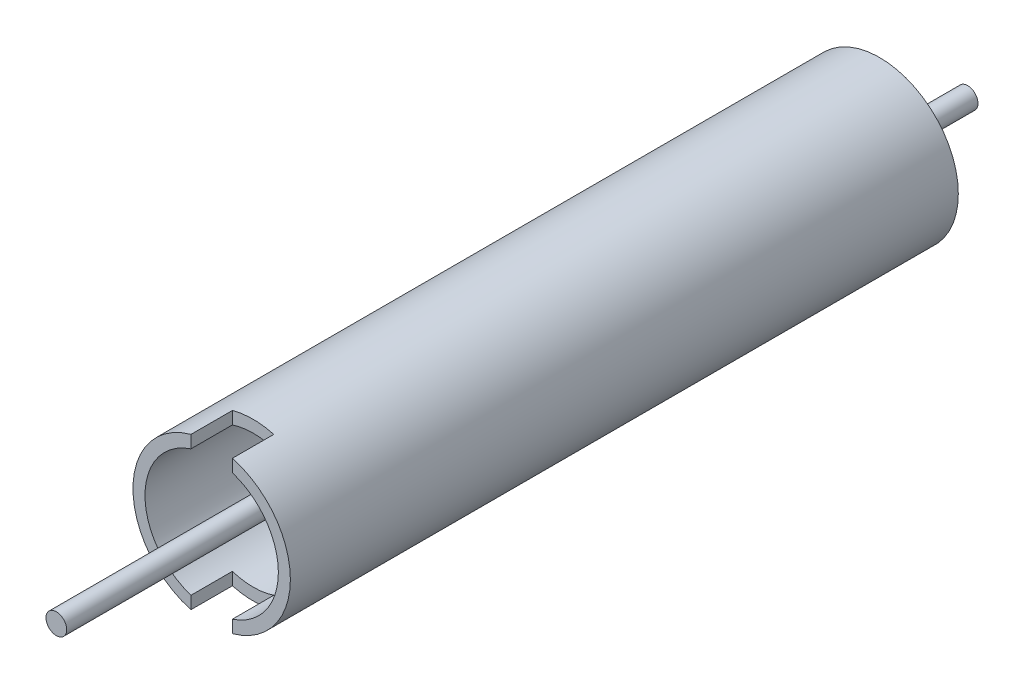
ISO-10303-21;
HEADER;
FILE_DESCRIPTION(('STEP AP214'),'2;1');
FILE_NAME('part.step','',(''),(''),'','','');
FILE_SCHEMA(('AUTOMOTIVE_DESIGN { 1 0 10303 214 1 1 1 1 }'));
ENDSEC;
DATA;
#1=APPLICATION_CONTEXT('core data for automotive mechanical design processes');
#2=APPLICATION_PROTOCOL_DEFINITION('international standard','automotive_design',2000,#1);
#3=PRODUCT_CONTEXT('',#1,'mechanical');
#4=PRODUCT('Part','Part','',(#3));
#5=PRODUCT_RELATED_PRODUCT_CATEGORY('part','',(#4));
#6=PRODUCT_DEFINITION_FORMATION('','',#4);
#7=PRODUCT_DEFINITION_CONTEXT('part definition',#1,'design');
#8=PRODUCT_DEFINITION('design','',#6,#7);
#9=PRODUCT_DEFINITION_SHAPE('','',#8);
#10=(LENGTH_UNIT() NAMED_UNIT(*) SI_UNIT(.MILLI.,.METRE.));
#11=(NAMED_UNIT(*) PLANE_ANGLE_UNIT() SI_UNIT($,.RADIAN.));
#12=(NAMED_UNIT(*) SI_UNIT($,.STERADIAN.) SOLID_ANGLE_UNIT());
#13=UNCERTAINTY_MEASURE_WITH_UNIT(LENGTH_MEASURE(1.E-05),#10,'distance_accuracy_value','');
#14=(GEOMETRIC_REPRESENTATION_CONTEXT(3) GLOBAL_UNCERTAINTY_ASSIGNED_CONTEXT((#13)) GLOBAL_UNIT_ASSIGNED_CONTEXT((#10,
#11,#12)) REPRESENTATION_CONTEXT('',''));
#15=CARTESIAN_POINT('',(0.,0.,0.));
#16=DIRECTION('',(0.,0.,1.));
#17=DIRECTION('',(1.,0.,0.));
#18=AXIS2_PLACEMENT_3D('',#15,#16,#17);
#19=CARTESIAN_POINT('',(0.,0.,92.075));
#20=DIRECTION('',(0.,0.,1.));
#21=DIRECTION('',(1.,0.,0.));
#22=AXIS2_PLACEMENT_3D('',#19,#20,#21);
#23=PLANE('',#22);
#24=CARTESIAN_POINT('',(0.,0.,92.075));
#25=DIRECTION('',(0.,0.,1.));
#26=DIRECTION('',(1.,0.,0.));
#27=AXIS2_PLACEMENT_3D('',#24,#25,#26);
#28=CIRCLE('',#27,24.13);
#29=CARTESIAN_POINT('',(-6.35000000000003,23.2794845303757,92.075));
#30=VERTEX_POINT('',#29);
#31=CARTESIAN_POINT('',(-6.35000000000003,-23.2794845303757,92.075));
#32=VERTEX_POINT('',#31);
#33=EDGE_CURVE('E197',#30,#32,#28,.T.);
#34=ORIENTED_EDGE('',*,*,#33,.T.);
#35=DIRECTION('',(0.,-1.,0.));
#36=VECTOR('',#35,1.);
#37=CARTESIAN_POINT('',(-6.35000000000003,-19.4359797540541,92.075));
#38=LINE('',#37,#36);
#39=CARTESIAN_POINT('',(-6.35000000000003,-19.4359797540541,92.075));
#40=VERTEX_POINT('',#39);
#41=EDGE_CURVE('E146',#40,#32,#38,.T.);
#42=ORIENTED_EDGE('',*,*,#41,.F.);
#43=CARTESIAN_POINT('',(0.,0.,92.075));
#44=DIRECTION('',(0.,0.,1.));
#45=DIRECTION('',(1.,0.,0.));
#46=AXIS2_PLACEMENT_3D('',#43,#44,#45);
#47=CIRCLE('',#46,20.447);
#48=CARTESIAN_POINT('',(-6.35000000000003,19.4359797540541,92.075));
#49=VERTEX_POINT('',#48);
#50=EDGE_CURVE('E193',#49,#40,#47,.T.);
#51=ORIENTED_EDGE('',*,*,#50,.F.);
#52=DIRECTION('',(0.,1.,0.));
#53=VECTOR('',#52,1.);
#54=CARTESIAN_POINT('',(-6.35000000000003,19.4359797540541,92.075));
#55=LINE('',#54,#53);
#56=EDGE_CURVE('E161',#49,#30,#55,.T.);
#57=ORIENTED_EDGE('',*,*,#56,.T.);
#58=EDGE_LOOP('',(#34,#42,#51,#57));
#59=FACE_BOUND('',#58,.T.);
#60=ADVANCED_FACE('F46',(#59),#23,.T.);
#61=CARTESIAN_POINT('',(0.,0.,-112.7125));
#62=DIRECTION('',(0.,0.,1.));
#63=DIRECTION('',(1.,0.,0.));
#64=AXIS2_PLACEMENT_3D('',#61,#62,#63);
#65=CYLINDRICAL_SURFACE('',#64,24.13);
#66=DIRECTION('',(0.,0.,1.));
#67=VECTOR('',#66,1.);
#68=CARTESIAN_POINT('',(6.34999999999999,-23.2794845303757,-112.7125));
#69=LINE('',#68,#67);
#70=CARTESIAN_POINT('',(6.34999999999999,-23.2794845303757,92.075));
#71=VERTEX_POINT('',#70);
#72=CARTESIAN_POINT('',(6.34999999999999,-23.2794845303757,79.3749999999999));
#73=VERTEX_POINT('',#72);
#74=EDGE_CURVE('E130',#71,#73,#69,.F.);
#75=ORIENTED_EDGE('',*,*,#74,.T.);
#76=CARTESIAN_POINT('',(0.,0.,79.3749999999999));
#77=DIRECTION('',(0.,0.,1.));
#78=DIRECTION('',(1.,0.,0.));
#79=AXIS2_PLACEMENT_3D('',#76,#77,#78);
#80=CIRCLE('',#79,24.13);
#81=CARTESIAN_POINT('',(-6.35000000000003,-23.2794845303757,79.3749999999999));
#82=VERTEX_POINT('',#81);
#83=EDGE_CURVE('E114',#82,#73,#80,.T.);
#84=ORIENTED_EDGE('',*,*,#83,.F.);
#85=DIRECTION('',(0.,0.,1.));
#86=VECTOR('',#85,1.);
#87=CARTESIAN_POINT('',(-6.35000000000003,-23.2794845303757,-112.7125));
#88=LINE('',#87,#86);
#89=EDGE_CURVE('E126',#32,#82,#88,.F.);
#90=ORIENTED_EDGE('',*,*,#89,.F.);
#91=ORIENTED_EDGE('',*,*,#33,.F.);
#92=DIRECTION('',(0.,0.,1.));
#93=VECTOR('',#92,1.);
#94=CARTESIAN_POINT('',(-6.35000000000003,23.2794845303757,-112.7125));
#95=LINE('',#94,#93);
#96=CARTESIAN_POINT('',(-6.35000000000003,23.2794845303757,79.3749999999999));
#97=VERTEX_POINT('',#96);
#98=EDGE_CURVE('E168',#30,#97,#95,.F.);
#99=ORIENTED_EDGE('',*,*,#98,.T.);
#100=CARTESIAN_POINT('',(0.,0.,79.3749999999999));
#101=DIRECTION('',(0.,0.,-1.));
#102=DIRECTION('',(-1.,0.,0.));
#103=AXIS2_PLACEMENT_3D('',#100,#101,#102);
#104=CIRCLE('',#103,24.13);
#105=CARTESIAN_POINT('',(6.34999999999999,23.2794845303757,79.3749999999999));
#106=VERTEX_POINT('',#105);
#107=EDGE_CURVE('E162',#97,#106,#104,.T.);
#108=ORIENTED_EDGE('',*,*,#107,.T.);
#109=DIRECTION('',(0.,0.,1.));
#110=VECTOR('',#109,1.);
#111=CARTESIAN_POINT('',(6.34999999999999,23.2794845303757,-112.7125));
#112=LINE('',#111,#110);
#113=CARTESIAN_POINT('',(6.34999999999999,23.2794845303757,92.075));
#114=VERTEX_POINT('',#113);
#115=EDGE_CURVE('E172',#114,#106,#112,.F.);
#116=ORIENTED_EDGE('',*,*,#115,.F.);
#117=EDGE_CURVE('E140',#71,#114,#28,.T.);
#118=ORIENTED_EDGE('',*,*,#117,.F.);
#119=EDGE_LOOP('',(#75,#84,#90,#91,#99,#108,#116,#118));
#120=FACE_BOUND('',#119,.T.);
#121=CARTESIAN_POINT('',(0.,0.,-112.7125));
#122=DIRECTION('',(0.,0.,1.));
#123=DIRECTION('',(1.,0.,0.));
#124=AXIS2_PLACEMENT_3D('',#121,#122,#123);
#125=CIRCLE('',#124,24.13);
#126=CARTESIAN_POINT('',(24.13,0.,-112.7125));
#127=VERTEX_POINT('',#126);
#128=EDGE_CURVE('E12',#127,#127,#125,.T.);
#129=ORIENTED_EDGE('',*,*,#128,.T.);
#130=EDGE_LOOP('',(#129));
#131=FACE_BOUND('',#130,.T.);
#132=ADVANCED_FACE('F48',(#120,#131),#65,.T.);
#133=CARTESIAN_POINT('',(0.,0.,-112.7125));
#134=DIRECTION('',(0.,0.,1.));
#135=DIRECTION('',(1.,0.,0.));
#136=AXIS2_PLACEMENT_3D('',#133,#134,#135);
#137=PLANE('',#136);
#138=CARTESIAN_POINT('',(0.,0.,-112.7125));
#139=DIRECTION('',(0.,0.,1.));
#140=DIRECTION('',(1.,0.,0.));
#141=AXIS2_PLACEMENT_3D('',#138,#139,#140);
#142=CIRCLE('',#141,20.447);
#143=CARTESIAN_POINT('',(20.447,0.,-112.7125));
#144=VERTEX_POINT('',#143);
#145=EDGE_CURVE('E55',#144,#144,#142,.T.);
#146=ORIENTED_EDGE('',*,*,#145,.T.);
#147=EDGE_LOOP('',(#146));
#148=FACE_BOUND('',#147,.T.);
#149=ORIENTED_EDGE('',*,*,#128,.F.);
#150=EDGE_LOOP('',(#149));
#151=FACE_BOUND('',#150,.T.);
#152=ADVANCED_FACE('F204',(#148,#151),#137,.F.);
#153=CARTESIAN_POINT('',(0.,0.,-112.7125));
#154=DIRECTION('',(0.,0.,1.));
#155=DIRECTION('',(1.,0.,0.));
#156=AXIS2_PLACEMENT_3D('',#153,#154,#155);
#157=CYLINDRICAL_SURFACE('',#156,20.447);
#158=CARTESIAN_POINT('',(0.,0.,79.375));
#159=DIRECTION('',(0.,0.,-1.));
#160=DIRECTION('',(-1.,0.,0.));
#161=AXIS2_PLACEMENT_3D('',#158,#159,#160);
#162=CIRCLE('',#161,20.447);
#163=CARTESIAN_POINT('',(6.34999999999999,-19.4359797540541,79.3749999999999));
#164=VERTEX_POINT('',#163);
#165=CARTESIAN_POINT('',(-6.35000000000003,-19.4359797540541,79.3749999999999));
#166=VERTEX_POINT('',#165);
#167=EDGE_CURVE('E125',#164,#166,#162,.T.);
#168=ORIENTED_EDGE('',*,*,#167,.F.);
#169=DIRECTION('',(0.,0.,1.));
#170=VECTOR('',#169,1.);
#171=CARTESIAN_POINT('',(6.34999999999999,-19.4359797540541,-112.7125));
#172=LINE('',#171,#170);
#173=CARTESIAN_POINT('',(6.34999999999999,-19.4359797540541,92.0749999999999));
#174=VERTEX_POINT('',#173);
#175=EDGE_CURVE('E132',#164,#174,#172,.T.);
#176=ORIENTED_EDGE('',*,*,#175,.T.);
#177=CARTESIAN_POINT('',(6.34999999999999,19.4359797540541,92.075));
#178=VERTEX_POINT('',#177);
#179=EDGE_CURVE('E70',#174,#178,#47,.T.);
#180=ORIENTED_EDGE('',*,*,#179,.T.);
#181=DIRECTION('',(0.,0.,1.));
#182=VECTOR('',#181,1.);
#183=CARTESIAN_POINT('',(6.34999999999999,19.4359797540541,-112.7125));
#184=LINE('',#183,#182);
#185=CARTESIAN_POINT('',(6.34999999999999,19.4359797540541,79.3749999999999));
#186=VERTEX_POINT('',#185);
#187=EDGE_CURVE('E169',#186,#178,#184,.T.);
#188=ORIENTED_EDGE('',*,*,#187,.F.);
#189=CARTESIAN_POINT('',(0.,0.,79.375));
#190=DIRECTION('',(0.,0.,1.));
#191=DIRECTION('',(1.,0.,0.));
#192=AXIS2_PLACEMENT_3D('',#189,#190,#191);
#193=CIRCLE('',#192,20.447);
#194=CARTESIAN_POINT('',(-6.35000000000003,19.4359797540541,79.3749999999999));
#195=VERTEX_POINT('',#194);
#196=EDGE_CURVE('E157',#186,#195,#193,.T.);
#197=ORIENTED_EDGE('',*,*,#196,.T.);
#198=DIRECTION('',(0.,0.,1.));
#199=VECTOR('',#198,1.);
#200=CARTESIAN_POINT('',(-6.35000000000003,19.4359797540541,-112.7125));
#201=LINE('',#200,#199);
#202=EDGE_CURVE('E163',#195,#49,#201,.T.);
#203=ORIENTED_EDGE('',*,*,#202,.T.);
#204=ORIENTED_EDGE('',*,*,#50,.T.);
#205=DIRECTION('',(0.,0.,1.));
#206=VECTOR('',#205,1.);
#207=CARTESIAN_POINT('',(-6.35000000000003,-19.4359797540541,-112.7125));
#208=LINE('',#207,#206);
#209=EDGE_CURVE('E62',#166,#40,#208,.T.);
#210=ORIENTED_EDGE('',*,*,#209,.F.);
#211=EDGE_LOOP('',(#168,#176,#180,#188,#197,#203,#204,#210));
#212=FACE_BOUND('',#211,.T.);
#213=ORIENTED_EDGE('',*,*,#145,.F.);
#214=EDGE_LOOP('',(#213));
#215=FACE_BOUND('',#214,.T.);
#216=ADVANCED_FACE('F207',(#212,#215),#157,.F.);
#217=DIRECTION('',(0.,-1.,0.));
#218=VECTOR('',#217,1.);
#219=CARTESIAN_POINT('',(6.34999999999999,-19.4359797540541,92.075));
#220=LINE('',#219,#218);
#221=EDGE_CURVE('E142',#174,#71,#220,.T.);
#222=ORIENTED_EDGE('',*,*,#221,.T.);
#223=ORIENTED_EDGE('',*,*,#117,.T.);
#224=DIRECTION('',(0.,1.,0.));
#225=VECTOR('',#224,1.);
#226=CARTESIAN_POINT('',(6.34999999999999,19.4359797540541,92.075));
#227=LINE('',#226,#225);
#228=EDGE_CURVE('E167',#178,#114,#227,.T.);
#229=ORIENTED_EDGE('',*,*,#228,.F.);
#230=ORIENTED_EDGE('',*,*,#179,.F.);
#231=EDGE_LOOP('',(#222,#223,#229,#230));
#232=FACE_BOUND('',#231,.T.);
#233=ADVANCED_FACE('F209',(#232),#23,.T.);
#234=CARTESIAN_POINT('',(-6.35000000000003,19.4359797540541,79.3749999999999));
#235=DIRECTION('',(0.,0.,-1.));
#236=DIRECTION('',(-1.,0.,0.));
#237=AXIS2_PLACEMENT_3D('',#234,#235,#236);
#238=PLANE('',#237);
#239=DIRECTION('',(0.,1.,0.));
#240=VECTOR('',#239,1.);
#241=CARTESIAN_POINT('',(-6.35000000000003,19.4359797540541,79.3749999999999));
#242=LINE('',#241,#240);
#243=EDGE_CURVE('E135',#195,#97,#242,.T.);
#244=ORIENTED_EDGE('',*,*,#243,.F.);
#245=ORIENTED_EDGE('',*,*,#196,.F.);
#246=DIRECTION('',(0.,1.,0.));
#247=VECTOR('',#246,1.);
#248=CARTESIAN_POINT('',(6.34999999999999,19.4359797540541,79.3749999999999));
#249=LINE('',#248,#247);
#250=EDGE_CURVE('E173',#186,#106,#249,.T.);
#251=ORIENTED_EDGE('',*,*,#250,.T.);
#252=ORIENTED_EDGE('',*,*,#107,.F.);
#253=EDGE_LOOP('',(#244,#245,#251,#252));
#254=FACE_BOUND('',#253,.T.);
#255=ADVANCED_FACE('F215',(#254),#238,.F.);
#256=CARTESIAN_POINT('',(-6.35000000000003,19.4359797540541,-112.7125));
#257=DIRECTION('',(-1.,0.,0.));
#258=DIRECTION('',(0.,0.,1.));
#259=AXIS2_PLACEMENT_3D('',#256,#257,#258);
#260=PLANE('',#259);
#261=ORIENTED_EDGE('',*,*,#56,.F.);
#262=ORIENTED_EDGE('',*,*,#202,.F.);
#263=ORIENTED_EDGE('',*,*,#243,.T.);
#264=ORIENTED_EDGE('',*,*,#98,.F.);
#265=EDGE_LOOP('',(#261,#262,#263,#264));
#266=FACE_BOUND('',#265,.T.);
#267=ADVANCED_FACE('F227',(#266),#260,.F.);
#268=CARTESIAN_POINT('',(6.34999999999999,19.4359797540541,-112.7125));
#269=DIRECTION('',(-1.,0.,0.));
#270=DIRECTION('',(0.,0.,1.));
#271=AXIS2_PLACEMENT_3D('',#268,#269,#270);
#272=PLANE('',#271);
#273=ORIENTED_EDGE('',*,*,#115,.T.);
#274=ORIENTED_EDGE('',*,*,#250,.F.);
#275=ORIENTED_EDGE('',*,*,#187,.T.);
#276=ORIENTED_EDGE('',*,*,#228,.T.);
#277=EDGE_LOOP('',(#273,#274,#275,#276));
#278=FACE_BOUND('',#277,.T.);
#279=ADVANCED_FACE('F231',(#278),#272,.T.);
#280=CARTESIAN_POINT('',(6.34999999999999,-19.4359797540541,-112.7125));
#281=DIRECTION('',(1.,0.,0.));
#282=DIRECTION('',(0.,0.,-1.));
#283=AXIS2_PLACEMENT_3D('',#280,#281,#282);
#284=PLANE('',#283);
#285=ORIENTED_EDGE('',*,*,#221,.F.);
#286=ORIENTED_EDGE('',*,*,#175,.F.);
#287=DIRECTION('',(0.,-1.,0.));
#288=VECTOR('',#287,1.);
#289=CARTESIAN_POINT('',(6.34999999999999,-19.4359797540541,79.3749999999999));
#290=LINE('',#289,#288);
#291=EDGE_CURVE('E118',#164,#73,#290,.T.);
#292=ORIENTED_EDGE('',*,*,#291,.T.);
#293=ORIENTED_EDGE('',*,*,#74,.F.);
#294=EDGE_LOOP('',(#285,#286,#292,#293));
#295=FACE_BOUND('',#294,.T.);
#296=ADVANCED_FACE('F129',(#295),#284,.F.);
#297=CARTESIAN_POINT('',(-6.35000000000003,-19.4359797540541,-112.7125));
#298=DIRECTION('',(1.,0.,0.));
#299=DIRECTION('',(0.,0.,-1.));
#300=AXIS2_PLACEMENT_3D('',#297,#298,#299);
#301=PLANE('',#300);
#302=ORIENTED_EDGE('',*,*,#89,.T.);
#303=DIRECTION('',(0.,-1.,0.));
#304=VECTOR('',#303,1.);
#305=CARTESIAN_POINT('',(-6.35000000000003,-19.4359797540541,79.3749999999999));
#306=LINE('',#305,#304);
#307=EDGE_CURVE('E120',#166,#82,#306,.T.);
#308=ORIENTED_EDGE('',*,*,#307,.F.);
#309=ORIENTED_EDGE('',*,*,#209,.T.);
#310=ORIENTED_EDGE('',*,*,#41,.T.);
#311=EDGE_LOOP('',(#302,#308,#309,#310));
#312=FACE_BOUND('',#311,.T.);
#313=ADVANCED_FACE('F238',(#312),#301,.T.);
#314=CARTESIAN_POINT('',(-6.35000000000003,-19.4359797540541,79.3749999999999));
#315=DIRECTION('',(0.,0.,1.));
#316=DIRECTION('',(1.,0.,0.));
#317=AXIS2_PLACEMENT_3D('',#314,#315,#316);
#318=PLANE('',#317);
#319=ORIENTED_EDGE('',*,*,#83,.T.);
#320=ORIENTED_EDGE('',*,*,#291,.F.);
#321=ORIENTED_EDGE('',*,*,#167,.T.);
#322=ORIENTED_EDGE('',*,*,#307,.T.);
#323=EDGE_LOOP('',(#319,#320,#321,#322));
#324=FACE_BOUND('',#323,.T.);
#325=ADVANCED_FACE('F116',(#324),#318,.T.);
#326=CLOSED_SHELL('',(#60,#132,#152,#216,#233,#255,#267,#279,#296,#313,#325));
#327=MANIFOLD_SOLID_BREP('B2',#326);
#328=CARTESIAN_POINT('',(0.,0.,139.7));
#329=DIRECTION('',(0.,0.,-1.));
#330=DIRECTION('',(-1.,0.,0.));
#331=AXIS2_PLACEMENT_3D('',#328,#329,#330);
#332=CYLINDRICAL_SURFACE('',#331,3.175);
#333=CARTESIAN_POINT('',(0.,0.,139.7));
#334=DIRECTION('',(0.,0.,1.));
#335=DIRECTION('',(1.,0.,0.));
#336=AXIS2_PLACEMENT_3D('',#333,#334,#335);
#337=CIRCLE('',#336,3.175);
#338=CARTESIAN_POINT('',(3.175,0.,139.7));
#339=VERTEX_POINT('',#338);
#340=EDGE_CURVE('E45',#339,#339,#337,.T.);
#341=ORIENTED_EDGE('',*,*,#340,.F.);
#342=EDGE_LOOP('',(#341));
#343=FACE_BOUND('',#342,.T.);
#344=CARTESIAN_POINT('',(0.,0.,-139.7));
#345=DIRECTION('',(0.,0.,1.));
#346=DIRECTION('',(1.,0.,0.));
#347=AXIS2_PLACEMENT_3D('',#344,#345,#346);
#348=CIRCLE('',#347,3.175);
#349=CARTESIAN_POINT('',(3.175,0.,-139.7));
#350=VERTEX_POINT('',#349);
#351=EDGE_CURVE('E320',#350,#350,#348,.T.);
#352=ORIENTED_EDGE('',*,*,#351,.T.);
#353=EDGE_LOOP('',(#352));
#354=FACE_BOUND('',#353,.T.);
#355=ADVANCED_FACE('F317',(#343,#354),#332,.T.);
#356=CARTESIAN_POINT('',(0.,0.,139.7));
#357=DIRECTION('',(0.,0.,1.));
#358=DIRECTION('',(1.,0.,0.));
#359=AXIS2_PLACEMENT_3D('',#356,#357,#358);
#360=PLANE('',#359);
#361=ORIENTED_EDGE('',*,*,#340,.T.);
#362=EDGE_LOOP('',(#361));
#363=FACE_BOUND('',#362,.T.);
#364=ADVANCED_FACE('F332',(#363),#360,.T.);
#365=CARTESIAN_POINT('',(0.,0.,-139.7));
#366=DIRECTION('',(0.,0.,1.));
#367=DIRECTION('',(1.,0.,0.));
#368=AXIS2_PLACEMENT_3D('',#365,#366,#367);
#369=PLANE('',#368);
#370=ORIENTED_EDGE('',*,*,#351,.F.);
#371=EDGE_LOOP('',(#370));
#372=FACE_BOUND('',#371,.T.);
#373=ADVANCED_FACE('F330',(#372),#369,.F.);
#374=CLOSED_SHELL('',(#355,#364,#373));
#375=MANIFOLD_SOLID_BREP('B6',#374);
#376=ADVANCED_BREP_SHAPE_REPRESENTATION('',(#18,#327,#375),#14);
#377=SHAPE_DEFINITION_REPRESENTATION(#9,#376);
ENDSEC;
END-ISO-10303-21;
